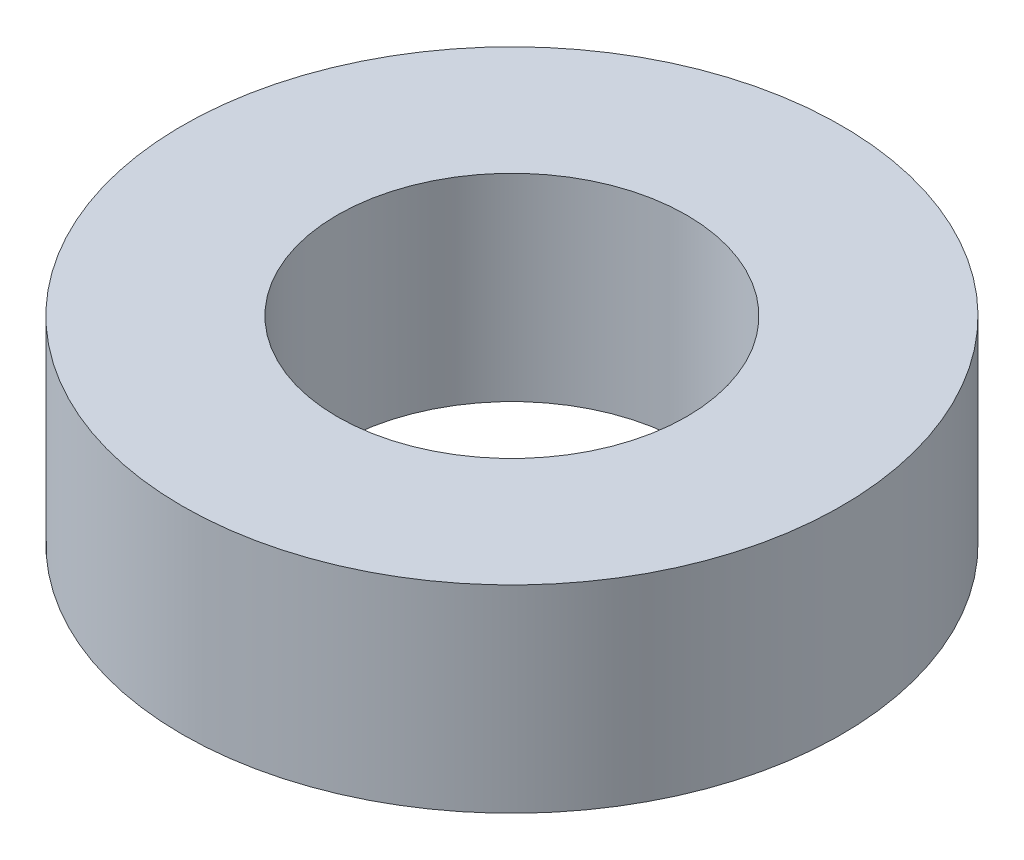
ISO-10303-21;
HEADER;
FILE_DESCRIPTION(('STEP AP214'),'2;1');
FILE_NAME('part.step','',(''),(''),'','','');
FILE_SCHEMA(('AUTOMOTIVE_DESIGN { 1 0 10303 214 1 1 1 1 }'));
ENDSEC;
DATA;
#1=APPLICATION_CONTEXT('core data for automotive mechanical design processes');
#2=APPLICATION_PROTOCOL_DEFINITION('international standard','automotive_design',2000,#1);
#3=PRODUCT_CONTEXT('',#1,'mechanical');
#4=PRODUCT('Part','Part','',(#3));
#5=PRODUCT_RELATED_PRODUCT_CATEGORY('part','',(#4));
#6=PRODUCT_DEFINITION_FORMATION('','',#4);
#7=PRODUCT_DEFINITION_CONTEXT('part definition',#1,'design');
#8=PRODUCT_DEFINITION('design','',#6,#7);
#9=PRODUCT_DEFINITION_SHAPE('','',#8);
#10=(LENGTH_UNIT() NAMED_UNIT(*) SI_UNIT(.MILLI.,.METRE.));
#11=(NAMED_UNIT(*) PLANE_ANGLE_UNIT() SI_UNIT($,.RADIAN.));
#12=(NAMED_UNIT(*) SI_UNIT($,.STERADIAN.) SOLID_ANGLE_UNIT());
#13=UNCERTAINTY_MEASURE_WITH_UNIT(LENGTH_MEASURE(1.E-05),#10,'distance_accuracy_value','');
#14=(GEOMETRIC_REPRESENTATION_CONTEXT(3) GLOBAL_UNCERTAINTY_ASSIGNED_CONTEXT((#13)) GLOBAL_UNIT_ASSIGNED_CONTEXT((#10,
#11,#12)) REPRESENTATION_CONTEXT('',''));
#15=CARTESIAN_POINT('',(0.,0.,0.));
#16=DIRECTION('',(0.,0.,1.));
#17=DIRECTION('',(1.,0.,0.));
#18=AXIS2_PLACEMENT_3D('',#15,#16,#17);
#19=CARTESIAN_POINT('',(0.,3.,0.));
#20=DIRECTION('',(0.,1.,0.));
#21=DIRECTION('',(0.,0.,1.));
#22=AXIS2_PLACEMENT_3D('',#19,#20,#21);
#23=PLANE('',#22);
#24=CARTESIAN_POINT('',(0.,3.,0.));
#25=DIRECTION('',(0.,1.,0.));
#26=DIRECTION('',(0.,0.,1.));
#27=AXIS2_PLACEMENT_3D('',#24,#25,#26);
#28=CIRCLE('',#27,5.);
#29=CARTESIAN_POINT('',(0.,3.,5.));
#30=VERTEX_POINT('',#29);
#31=EDGE_CURVE('E10',#30,#30,#28,.T.);
#32=ORIENTED_EDGE('',*,*,#31,.T.);
#33=EDGE_LOOP('',(#32));
#34=FACE_BOUND('',#33,.T.);
#35=CARTESIAN_POINT('',(0.,3.,0.));
#36=DIRECTION('',(0.,1.,0.));
#37=DIRECTION('',(0.,0.,1.));
#38=AXIS2_PLACEMENT_3D('',#35,#36,#37);
#39=CIRCLE('',#38,2.65);
#40=CARTESIAN_POINT('',(0.,3.,2.65));
#41=VERTEX_POINT('',#40);
#42=EDGE_CURVE('E42',#41,#41,#39,.T.);
#43=ORIENTED_EDGE('',*,*,#42,.F.);
#44=EDGE_LOOP('',(#43));
#45=FACE_BOUND('',#44,.T.);
#46=ADVANCED_FACE('F31',(#34,#45),#23,.T.);
#47=CARTESIAN_POINT('',(0.,0.,0.));
#48=DIRECTION('',(0.,1.,0.));
#49=DIRECTION('',(0.,0.,1.));
#50=AXIS2_PLACEMENT_3D('',#47,#48,#49);
#51=PLANE('',#50);
#52=CARTESIAN_POINT('',(0.,0.,0.));
#53=DIRECTION('',(0.,1.,0.));
#54=DIRECTION('',(0.,0.,1.));
#55=AXIS2_PLACEMENT_3D('',#52,#53,#54);
#56=CIRCLE('',#55,5.);
#57=CARTESIAN_POINT('',(0.,0.,5.));
#58=VERTEX_POINT('',#57);
#59=EDGE_CURVE('E35',#58,#58,#56,.T.);
#60=ORIENTED_EDGE('',*,*,#59,.F.);
#61=EDGE_LOOP('',(#60));
#62=FACE_BOUND('',#61,.T.);
#63=CARTESIAN_POINT('',(0.,0.,0.));
#64=DIRECTION('',(0.,1.,0.));
#65=DIRECTION('',(0.,0.,1.));
#66=AXIS2_PLACEMENT_3D('',#63,#64,#65);
#67=CIRCLE('',#66,2.65);
#68=CARTESIAN_POINT('',(0.,0.,2.65));
#69=VERTEX_POINT('',#68);
#70=EDGE_CURVE('E44',#69,#69,#67,.T.);
#71=ORIENTED_EDGE('',*,*,#70,.T.);
#72=EDGE_LOOP('',(#71));
#73=FACE_BOUND('',#72,.T.);
#74=ADVANCED_FACE('F54',(#62,#73),#51,.F.);
#75=CARTESIAN_POINT('',(0.,3.,0.));
#76=DIRECTION('',(0.,-1.,0.));
#77=DIRECTION('',(0.,0.,-1.));
#78=AXIS2_PLACEMENT_3D('',#75,#76,#77);
#79=CYLINDRICAL_SURFACE('',#78,5.);
#80=ORIENTED_EDGE('',*,*,#31,.F.);
#81=EDGE_LOOP('',(#80));
#82=FACE_BOUND('',#81,.T.);
#83=ORIENTED_EDGE('',*,*,#59,.T.);
#84=EDGE_LOOP('',(#83));
#85=FACE_BOUND('',#84,.T.);
#86=ADVANCED_FACE('F33',(#82,#85),#79,.T.);
#87=CARTESIAN_POINT('',(0.,3.,0.));
#88=DIRECTION('',(0.,-1.,0.));
#89=DIRECTION('',(0.,0.,-1.));
#90=AXIS2_PLACEMENT_3D('',#87,#88,#89);
#91=CYLINDRICAL_SURFACE('',#90,2.65);
#92=ORIENTED_EDGE('',*,*,#42,.T.);
#93=EDGE_LOOP('',(#92));
#94=FACE_BOUND('',#93,.T.);
#95=ORIENTED_EDGE('',*,*,#70,.F.);
#96=EDGE_LOOP('',(#95));
#97=FACE_BOUND('',#96,.T.);
#98=ADVANCED_FACE('F50',(#94,#97),#91,.F.);
#99=CLOSED_SHELL('',(#46,#74,#86,#98));
#100=MANIFOLD_SOLID_BREP('B2',#99);
#101=ADVANCED_BREP_SHAPE_REPRESENTATION('',(#18,#100),#14);
#102=SHAPE_DEFINITION_REPRESENTATION(#9,#101);
ENDSEC;
END-ISO-10303-21;
